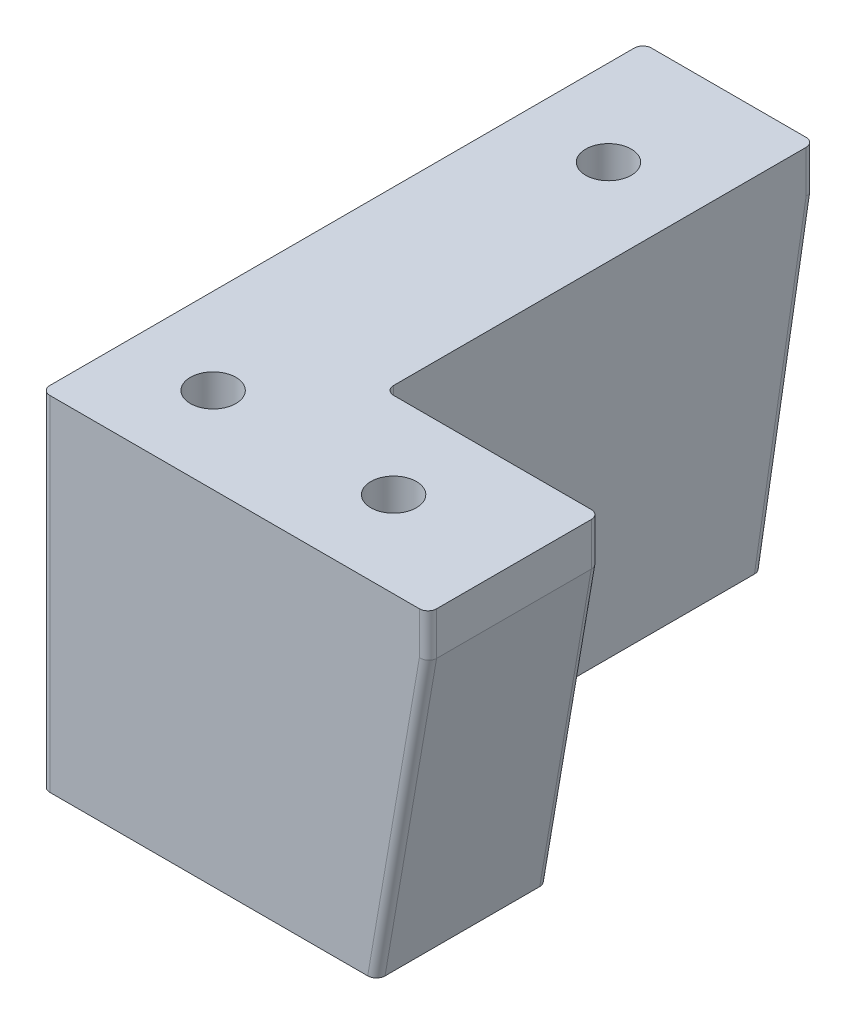
ISO-10303-21;
HEADER;
FILE_DESCRIPTION(('STEP AP214'),'2;1');
FILE_NAME('part.step','',(''),(''),'','','');
FILE_SCHEMA(('AUTOMOTIVE_DESIGN { 1 0 10303 214 1 1 1 1 }'));
ENDSEC;
DATA;
#1=APPLICATION_CONTEXT('core data for automotive mechanical design processes');
#2=APPLICATION_PROTOCOL_DEFINITION('international standard','automotive_design',2000,#1);
#3=PRODUCT_CONTEXT('',#1,'mechanical');
#4=PRODUCT('Part','Part','',(#3));
#5=PRODUCT_RELATED_PRODUCT_CATEGORY('part','',(#4));
#6=PRODUCT_DEFINITION_FORMATION('','',#4);
#7=PRODUCT_DEFINITION_CONTEXT('part definition',#1,'design');
#8=PRODUCT_DEFINITION('design','',#6,#7);
#9=PRODUCT_DEFINITION_SHAPE('','',#8);
#10=(LENGTH_UNIT() NAMED_UNIT(*) SI_UNIT(.MILLI.,.METRE.));
#11=(NAMED_UNIT(*) PLANE_ANGLE_UNIT() SI_UNIT($,.RADIAN.));
#12=(NAMED_UNIT(*) SI_UNIT($,.STERADIAN.) SOLID_ANGLE_UNIT());
#13=UNCERTAINTY_MEASURE_WITH_UNIT(LENGTH_MEASURE(1.E-05),#10,'distance_accuracy_value','');
#14=(GEOMETRIC_REPRESENTATION_CONTEXT(3) GLOBAL_UNCERTAINTY_ASSIGNED_CONTEXT((#13)) GLOBAL_UNIT_ASSIGNED_CONTEXT((#10,
#11,#12)) REPRESENTATION_CONTEXT('',''));
#15=CARTESIAN_POINT('',(0.,0.,0.));
#16=DIRECTION('',(0.,0.,1.));
#17=DIRECTION('',(1.,0.,0.));
#18=AXIS2_PLACEMENT_3D('',#15,#16,#17);
#19=CARTESIAN_POINT('',(31.,-5.,-10.));
#20=DIRECTION('',(0.,-1.,0.));
#21=DIRECTION('',(0.,0.,-1.));
#22=AXIS2_PLACEMENT_3D('',#19,#20,#21);
#23=PLANE('',#22);
#24=CARTESIAN_POINT('',(31.,-5.,-10.));
#25=DIRECTION('',(0.,-1.,0.));
#26=DIRECTION('',(0.,0.,-1.));
#27=AXIS2_PLACEMENT_3D('',#24,#25,#26);
#28=CIRCLE('',#27,5.);
#29=CARTESIAN_POINT('',(31.,-5.,-15.));
#30=VERTEX_POINT('',#29);
#31=EDGE_CURVE('E240',#30,#30,#28,.T.);
#32=ORIENTED_EDGE('',*,*,#31,.T.);
#33=EDGE_LOOP('',(#32));
#34=FACE_BOUND('',#33,.T.);
#35=CARTESIAN_POINT('',(31.,-5.,-10.));
#36=DIRECTION('',(0.,-1.,0.));
#37=DIRECTION('',(0.,0.,-1.));
#38=AXIS2_PLACEMENT_3D('',#35,#36,#37);
#39=CIRCLE('',#38,2.64999999999999);
#40=CARTESIAN_POINT('',(31.,-5.,-12.65));
#41=VERTEX_POINT('',#40);
#42=EDGE_CURVE('E274',#41,#41,#39,.F.);
#43=ORIENTED_EDGE('',*,*,#42,.T.);
#44=EDGE_LOOP('',(#43));
#45=FACE_BOUND('',#44,.T.);
#46=ADVANCED_FACE('F17',(#34,#45),#23,.T.);
#47=CARTESIAN_POINT('',(10.,-5.,-10.));
#48=DIRECTION('',(0.,-1.,0.));
#49=DIRECTION('',(0.,0.,-1.));
#50=AXIS2_PLACEMENT_3D('',#47,#48,#49);
#51=PLANE('',#50);
#52=CARTESIAN_POINT('',(10.,-5.,-10.));
#53=DIRECTION('',(0.,-1.,0.));
#54=DIRECTION('',(0.,0.,-1.));
#55=AXIS2_PLACEMENT_3D('',#52,#53,#54);
#56=CIRCLE('',#55,5.);
#57=CARTESIAN_POINT('',(10.,-5.,-15.));
#58=VERTEX_POINT('',#57);
#59=EDGE_CURVE('E267',#58,#58,#56,.T.);
#60=ORIENTED_EDGE('',*,*,#59,.T.);
#61=EDGE_LOOP('',(#60));
#62=FACE_BOUND('',#61,.T.);
#63=CARTESIAN_POINT('',(10.,-5.,-10.));
#64=DIRECTION('',(0.,-1.,0.));
#65=DIRECTION('',(0.,0.,-1.));
#66=AXIS2_PLACEMENT_3D('',#63,#64,#65);
#67=CIRCLE('',#66,2.64999999999999);
#68=CARTESIAN_POINT('',(10.,-5.,-12.65));
#69=VERTEX_POINT('',#68);
#70=EDGE_CURVE('E277',#69,#69,#67,.F.);
#71=ORIENTED_EDGE('',*,*,#70,.T.);
#72=EDGE_LOOP('',(#71));
#73=FACE_BOUND('',#72,.T.);
#74=ADVANCED_FACE('F592',(#62,#73),#51,.T.);
#75=CARTESIAN_POINT('',(10.,-5.,-56.));
#76=DIRECTION('',(0.,-1.,0.));
#77=DIRECTION('',(0.,0.,-1.));
#78=AXIS2_PLACEMENT_3D('',#75,#76,#77);
#79=PLANE('',#78);
#80=CARTESIAN_POINT('',(10.,-5.,-56.));
#81=DIRECTION('',(0.,-1.,0.));
#82=DIRECTION('',(0.,0.,-1.));
#83=AXIS2_PLACEMENT_3D('',#80,#81,#82);
#84=CIRCLE('',#83,5.);
#85=CARTESIAN_POINT('',(10.,-5.,-61.));
#86=VERTEX_POINT('',#85);
#87=EDGE_CURVE('E243',#86,#86,#84,.T.);
#88=ORIENTED_EDGE('',*,*,#87,.T.);
#89=EDGE_LOOP('',(#88));
#90=FACE_BOUND('',#89,.T.);
#91=CARTESIAN_POINT('',(10.,-5.,-56.));
#92=DIRECTION('',(0.,-1.,0.));
#93=DIRECTION('',(0.,0.,-1.));
#94=AXIS2_PLACEMENT_3D('',#91,#92,#93);
#95=CIRCLE('',#94,2.64999999999999);
#96=CARTESIAN_POINT('',(10.,-5.,-58.65));
#97=VERTEX_POINT('',#96);
#98=EDGE_CURVE('E234',#97,#97,#95,.F.);
#99=ORIENTED_EDGE('',*,*,#98,.T.);
#100=EDGE_LOOP('',(#99));
#101=FACE_BOUND('',#100,.T.);
#102=ADVANCED_FACE('F584',(#90,#101),#79,.T.);
#103=CARTESIAN_POINT('',(19.,-11.6311947891715,-67.8486362701669));
#104=DIRECTION('',(0.,-0.985622254813267,0.168963815110846));
#105=DIRECTION('',(0.,-0.168963815110846,-0.985622254813267));
#106=AXIS2_PLACEMENT_3D('',#103,#104,#105);
#107=CYLINDRICAL_SURFACE('',#106,1.00000000000001);
#108=CARTESIAN_POINT('',(19.,-4.91490636514522,-69.));
#109=DIRECTION('',(0.,0.996399080392306,-0.0847872195166623));
#110=DIRECTION('',(0.,0.0847872195166619,0.996399080392306));
#111=AXIS2_PLACEMENT_3D('',#108,#109,#110);
#112=ELLIPSE('',#111,1.00361393309022,1.);
#113=CARTESIAN_POINT('',(20.,-4.91490636514516,-69.));
#114=VERTEX_POINT('',#113);
#115=CARTESIAN_POINT('',(19.,-5.00000000000011,-70.));
#116=VERTEX_POINT('',#115);
#117=EDGE_CURVE('E135',#114,#116,#112,.T.);
#118=ORIENTED_EDGE('',*,*,#117,.F.);
#119=DIRECTION('',(0.,0.985622254813267,-0.168963815110846));
#120=VECTOR('',#119,1.);
#121=CARTESIAN_POINT('',(20.,-40.,-62.9854125197392));
#122=LINE('',#121,#120);
#123=CARTESIAN_POINT('',(20.,-40.,-62.9854125197392));
#124=VERTEX_POINT('',#123);
#125=EDGE_CURVE('E133',#124,#114,#122,.T.);
#126=ORIENTED_EDGE('',*,*,#125,.F.);
#127=CARTESIAN_POINT('',(19.,-40.,-62.9854125197392));
#128=DIRECTION('',(0.,-1.,0.));
#129=DIRECTION('',(0.,0.,1.));
#130=AXIS2_PLACEMENT_3D('',#127,#128,#129);
#131=ELLIPSE('',#130,1.01458748026085,1.00000000000001);
#132=CARTESIAN_POINT('',(19.,-40.,-64.));
#133=VERTEX_POINT('',#132);
#134=EDGE_CURVE('E20',#124,#133,#131,.F.);
#135=ORIENTED_EDGE('',*,*,#134,.T.);
#136=DIRECTION('',(0.,0.985622254813267,-0.168963815110846));
#137=VECTOR('',#136,1.);
#138=CARTESIAN_POINT('',(19.,-11.8001586042823,-68.8342585249802));
#139=LINE('',#138,#137);
#140=EDGE_CURVE('E130',#116,#133,#139,.F.);
#141=ORIENTED_EDGE('',*,*,#140,.F.);
#142=EDGE_LOOP('',(#118,#126,#135,#141));
#143=FACE_BOUND('',#142,.T.);
#144=ADVANCED_FACE('F129',(#143),#107,.T.);
#145=CARTESIAN_POINT('',(19.,-5.,-69.));
#146=DIRECTION('',(0.,1.,0.));
#147=DIRECTION('',(0.,0.,1.));
#148=AXIS2_PLACEMENT_3D('',#145,#146,#147);
#149=CYLINDRICAL_SURFACE('',#148,1.);
#150=CARTESIAN_POINT('',(19.,0.,-69.));
#151=DIRECTION('',(0.,1.,0.));
#152=DIRECTION('',(0.,0.,1.));
#153=AXIS2_PLACEMENT_3D('',#150,#151,#152);
#154=CIRCLE('',#153,1.);
#155=CARTESIAN_POINT('',(19.,0.,-70.));
#156=VERTEX_POINT('',#155);
#157=CARTESIAN_POINT('',(20.,0.,-69.));
#158=VERTEX_POINT('',#157);
#159=EDGE_CURVE('E297',#156,#158,#154,.F.);
#160=ORIENTED_EDGE('',*,*,#159,.T.);
#161=DIRECTION('',(0.,1.,0.));
#162=VECTOR('',#161,1.);
#163=CARTESIAN_POINT('',(20.,-5.,-69.));
#164=LINE('',#163,#162);
#165=EDGE_CURVE('E209',#114,#158,#164,.T.);
#166=ORIENTED_EDGE('',*,*,#165,.F.);
#167=ORIENTED_EDGE('',*,*,#117,.T.);
#168=DIRECTION('',(0.,1.,0.));
#169=VECTOR('',#168,1.);
#170=CARTESIAN_POINT('',(19.,-5.,-70.));
#171=LINE('',#170,#169);
#172=EDGE_CURVE('E230',#156,#116,#171,.F.);
#173=ORIENTED_EDGE('',*,*,#172,.F.);
#174=EDGE_LOOP('',(#160,#166,#167,#173));
#175=FACE_BOUND('',#174,.T.);
#176=ADVANCED_FACE('F301',(#175),#149,.T.);
#177=CARTESIAN_POINT('',(44.,-5.,-19.));
#178=DIRECTION('',(0.,1.,0.));
#179=DIRECTION('',(0.,0.,1.));
#180=AXIS2_PLACEMENT_3D('',#177,#178,#179);
#181=CYLINDRICAL_SURFACE('',#180,1.);
#182=CARTESIAN_POINT('',(44.,0.,-19.));
#183=DIRECTION('',(0.,1.,0.));
#184=DIRECTION('',(0.,0.,1.));
#185=AXIS2_PLACEMENT_3D('',#182,#183,#184);
#186=CIRCLE('',#185,1.);
#187=CARTESIAN_POINT('',(44.,0.,-20.));
#188=VERTEX_POINT('',#187);
#189=CARTESIAN_POINT('',(45.,0.,-19.));
#190=VERTEX_POINT('',#189);
#191=EDGE_CURVE('E295',#188,#190,#186,.F.);
#192=ORIENTED_EDGE('',*,*,#191,.T.);
#193=DIRECTION('',(0.,1.,0.));
#194=VECTOR('',#193,1.);
#195=CARTESIAN_POINT('',(45.,-5.,-19.));
#196=LINE('',#195,#194);
#197=CARTESIAN_POINT('',(45.,-5.00000000000007,-19.));
#198=VERTEX_POINT('',#197);
#199=EDGE_CURVE('E231',#198,#190,#196,.T.);
#200=ORIENTED_EDGE('',*,*,#199,.F.);
#201=CARTESIAN_POINT('',(44.,-4.91490636514523,-19.));
#202=DIRECTION('',(-0.0847872195166622,-0.996399080392306,0.));
#203=DIRECTION('',(-0.996399080392306,0.0847872195166613,0.));
#204=AXIS2_PLACEMENT_3D('',#201,#202,#203);
#205=ELLIPSE('',#204,1.00361393309022,1.);
#206=CARTESIAN_POINT('',(44.,-4.91490636514521,-20.));
#207=VERTEX_POINT('',#206);
#208=EDGE_CURVE('E290',#207,#198,#205,.T.);
#209=ORIENTED_EDGE('',*,*,#208,.F.);
#210=DIRECTION('',(0.,1.,0.));
#211=VECTOR('',#210,1.);
#212=CARTESIAN_POINT('',(44.,-5.,-20.));
#213=LINE('',#212,#211);
#214=EDGE_CURVE('E207',#188,#207,#213,.F.);
#215=ORIENTED_EDGE('',*,*,#214,.F.);
#216=EDGE_LOOP('',(#192,#200,#209,#215));
#217=FACE_BOUND('',#216,.T.);
#218=ADVANCED_FACE('F358',(#217),#181,.T.);
#219=CARTESIAN_POINT('',(44.0143777451868,-4.83103618488916,-19.));
#220=DIRECTION('',(-0.168963815110846,-0.985622254813267,0.));
#221=DIRECTION('',(0.985622254813267,-0.168963815110846,0.));
#222=AXIS2_PLACEMENT_3D('',#219,#220,#221);
#223=CYLINDRICAL_SURFACE('',#222,1.);
#224=ORIENTED_EDGE('',*,*,#208,.T.);
#225=DIRECTION('',(0.168963815110846,0.985622254813267,0.));
#226=VECTOR('',#225,1.);
#227=CARTESIAN_POINT('',(44.5479777954005,-7.63679619349722,-19.));
#228=LINE('',#227,#226);
#229=CARTESIAN_POINT('',(39.,-40.,-19.));
#230=VERTEX_POINT('',#229);
#231=EDGE_CURVE('E215',#230,#198,#228,.T.);
#232=ORIENTED_EDGE('',*,*,#231,.F.);
#233=CARTESIAN_POINT('',(37.9854125197392,-40.,-19.));
#234=DIRECTION('',(0.,-1.,0.));
#235=DIRECTION('',(-1.,0.,0.));
#236=AXIS2_PLACEMENT_3D('',#233,#234,#235);
#237=ELLIPSE('',#236,1.01458748026084,1.);
#238=CARTESIAN_POINT('',(37.9854125197392,-40.,-20.));
#239=VERTEX_POINT('',#238);
#240=EDGE_CURVE('E293',#230,#239,#237,.F.);
#241=ORIENTED_EDGE('',*,*,#240,.T.);
#242=DIRECTION('',(-0.168963815110846,-0.985622254813267,0.));
#243=VECTOR('',#242,1.);
#244=CARTESIAN_POINT('',(44.,-4.9149063651452,-20.));
#245=LINE('',#244,#243);
#246=EDGE_CURVE('E204',#207,#239,#245,.T.);
#247=ORIENTED_EDGE('',*,*,#246,.F.);
#248=EDGE_LOOP('',(#224,#232,#241,#247));
#249=FACE_BOUND('',#248,.T.);
#250=ADVANCED_FACE('F325',(#249),#223,.T.);
#251=CARTESIAN_POINT('',(21.,-5.,-21.));
#252=DIRECTION('',(0.,-1.,0.));
#253=DIRECTION('',(0.,0.,-1.));
#254=AXIS2_PLACEMENT_3D('',#251,#252,#253);
#255=CYLINDRICAL_SURFACE('',#254,1.);
#256=DIRECTION('',(0.,1.,0.));
#257=VECTOR('',#256,1.);
#258=CARTESIAN_POINT('',(20.,-5.,-21.));
#259=LINE('',#258,#257);
#260=CARTESIAN_POINT('',(20.,0.,-21.));
#261=VERTEX_POINT('',#260);
#262=CARTESIAN_POINT('',(20.,-40.,-21.));
#263=VERTEX_POINT('',#262);
#264=EDGE_CURVE('E143',#261,#263,#259,.F.);
#265=ORIENTED_EDGE('',*,*,#264,.F.);
#266=CARTESIAN_POINT('',(21.,0.,-21.));
#267=DIRECTION('',(0.,-1.,0.));
#268=DIRECTION('',(0.,0.,-1.));
#269=AXIS2_PLACEMENT_3D('',#266,#267,#268);
#270=CIRCLE('',#269,1.);
#271=CARTESIAN_POINT('',(21.,0.,-20.));
#272=VERTEX_POINT('',#271);
#273=EDGE_CURVE('E288',#272,#261,#270,.T.);
#274=ORIENTED_EDGE('',*,*,#273,.F.);
#275=DIRECTION('',(0.,1.,0.));
#276=VECTOR('',#275,1.);
#277=CARTESIAN_POINT('',(21.,-5.,-20.));
#278=LINE('',#277,#276);
#279=CARTESIAN_POINT('',(21.,-40.,-20.));
#280=VERTEX_POINT('',#279);
#281=EDGE_CURVE('E200',#280,#272,#278,.T.);
#282=ORIENTED_EDGE('',*,*,#281,.F.);
#283=CARTESIAN_POINT('',(21.,-40.,-21.));
#284=DIRECTION('',(0.,-1.,0.));
#285=DIRECTION('',(0.,0.,-1.));
#286=AXIS2_PLACEMENT_3D('',#283,#284,#285);
#287=CIRCLE('',#286,1.);
#288=EDGE_CURVE('E286',#263,#280,#287,.F.);
#289=ORIENTED_EDGE('',*,*,#288,.F.);
#290=EDGE_LOOP('',(#265,#274,#282,#289));
#291=FACE_BOUND('',#290,.T.);
#292=ADVANCED_FACE('F318',(#291),#255,.F.);
#293=CARTESIAN_POINT('',(43.5623555405872,-7.46783237838638,-1.));
#294=DIRECTION('',(-0.168963815110846,-0.985622254813267,0.));
#295=DIRECTION('',(0.985622254813267,-0.168963815110846,0.));
#296=AXIS2_PLACEMENT_3D('',#293,#294,#295);
#297=CYLINDRICAL_SURFACE('',#296,1.);
#298=CARTESIAN_POINT('',(44.,-4.91490636514519,-1.));
#299=DIRECTION('',(0.0847872195166622,0.996399080392306,0.));
#300=DIRECTION('',(-0.996399080392306,0.0847872195166613,0.));
#301=AXIS2_PLACEMENT_3D('',#298,#299,#300);
#302=ELLIPSE('',#301,1.00361393309022,1.);
#303=CARTESIAN_POINT('',(44.,-4.91490636514526,0.));
#304=VERTEX_POINT('',#303);
#305=CARTESIAN_POINT('',(45.,-5.00000000000005,-1.));
#306=VERTEX_POINT('',#305);
#307=EDGE_CURVE('E282',#304,#306,#302,.T.);
#308=ORIENTED_EDGE('',*,*,#307,.F.);
#309=DIRECTION('',(0.168963815110846,0.985622254813267,0.));
#310=VECTOR('',#309,1.);
#311=CARTESIAN_POINT('',(37.9854125197392,-40.,0.));
#312=LINE('',#311,#310);
#313=CARTESIAN_POINT('',(37.9854125197392,-40.,0.));
#314=VERTEX_POINT('',#313);
#315=EDGE_CURVE('E203',#314,#304,#312,.T.);
#316=ORIENTED_EDGE('',*,*,#315,.F.);
#317=CARTESIAN_POINT('',(37.9854125197392,-40.,-1.));
#318=DIRECTION('',(0.,-1.,0.));
#319=DIRECTION('',(-1.,0.,0.));
#320=AXIS2_PLACEMENT_3D('',#317,#318,#319);
#321=ELLIPSE('',#320,1.01458748026084,1.);
#322=CARTESIAN_POINT('',(39.,-40.,-1.));
#323=VERTEX_POINT('',#322);
#324=EDGE_CURVE('E284',#314,#323,#321,.F.);
#325=ORIENTED_EDGE('',*,*,#324,.T.);
#326=DIRECTION('',(0.168963815110846,0.985622254813267,0.));
#327=VECTOR('',#326,1.);
#328=CARTESIAN_POINT('',(44.5479777954005,-7.63679619349722,-1.));
#329=LINE('',#328,#327);
#330=EDGE_CURVE('E218',#306,#323,#329,.F.);
#331=ORIENTED_EDGE('',*,*,#330,.F.);
#332=EDGE_LOOP('',(#308,#316,#325,#331));
#333=FACE_BOUND('',#332,.T.);
#334=ADVANCED_FACE('F334',(#333),#297,.T.);
#335=CARTESIAN_POINT('',(44.,-5.,-1.));
#336=DIRECTION('',(0.,1.,0.));
#337=DIRECTION('',(0.,0.,1.));
#338=AXIS2_PLACEMENT_3D('',#335,#336,#337);
#339=CYLINDRICAL_SURFACE('',#338,1.);
#340=CARTESIAN_POINT('',(44.,0.,-1.));
#341=DIRECTION('',(0.,1.,0.));
#342=DIRECTION('',(0.,0.,1.));
#343=AXIS2_PLACEMENT_3D('',#340,#341,#342);
#344=CIRCLE('',#343,1.);
#345=CARTESIAN_POINT('',(45.,0.,-1.));
#346=VERTEX_POINT('',#345);
#347=CARTESIAN_POINT('',(44.,0.,0.));
#348=VERTEX_POINT('',#347);
#349=EDGE_CURVE('E280',#346,#348,#344,.F.);
#350=ORIENTED_EDGE('',*,*,#349,.T.);
#351=DIRECTION('',(0.,1.,0.));
#352=VECTOR('',#351,1.);
#353=CARTESIAN_POINT('',(44.,-5.,0.));
#354=LINE('',#353,#352);
#355=EDGE_CURVE('E214',#304,#348,#354,.T.);
#356=ORIENTED_EDGE('',*,*,#355,.F.);
#357=ORIENTED_EDGE('',*,*,#307,.T.);
#358=DIRECTION('',(0.,1.,0.));
#359=VECTOR('',#358,1.);
#360=CARTESIAN_POINT('',(45.,-5.,-1.));
#361=LINE('',#360,#359);
#362=EDGE_CURVE('E227',#346,#306,#361,.F.);
#363=ORIENTED_EDGE('',*,*,#362,.F.);
#364=EDGE_LOOP('',(#350,#356,#357,#363));
#365=FACE_BOUND('',#364,.T.);
#366=ADVANCED_FACE('F354',(#365),#339,.T.);
#367=CARTESIAN_POINT('',(10.,-5.,-10.));
#368=DIRECTION('',(0.,-1.,0.));
#369=DIRECTION('',(0.,0.,-1.));
#370=AXIS2_PLACEMENT_3D('',#367,#368,#369);
#371=CYLINDRICAL_SURFACE('',#370,2.64999999999999);
#372=CARTESIAN_POINT('',(10.,0.,-10.));
#373=DIRECTION('',(0.,-1.,0.));
#374=DIRECTION('',(0.,0.,-1.));
#375=AXIS2_PLACEMENT_3D('',#372,#373,#374);
#376=CIRCLE('',#375,2.64999999999999);
#377=CARTESIAN_POINT('',(10.,0.,-12.65));
#378=VERTEX_POINT('',#377);
#379=EDGE_CURVE('E237',#378,#378,#376,.T.);
#380=ORIENTED_EDGE('',*,*,#379,.F.);
#381=EDGE_LOOP('',(#380));
#382=FACE_BOUND('',#381,.T.);
#383=ORIENTED_EDGE('',*,*,#70,.F.);
#384=EDGE_LOOP('',(#383));
#385=FACE_BOUND('',#384,.T.);
#386=ADVANCED_FACE('F416',(#382,#385),#371,.F.);
#387=CARTESIAN_POINT('',(31.,-5.,-10.));
#388=DIRECTION('',(0.,-1.,0.));
#389=DIRECTION('',(0.,0.,-1.));
#390=AXIS2_PLACEMENT_3D('',#387,#388,#389);
#391=CYLINDRICAL_SURFACE('',#390,2.64999999999999);
#392=CARTESIAN_POINT('',(31.,0.,-10.));
#393=DIRECTION('',(0.,-1.,0.));
#394=DIRECTION('',(0.,0.,-1.));
#395=AXIS2_PLACEMENT_3D('',#392,#393,#394);
#396=CIRCLE('',#395,2.64999999999999);
#397=CARTESIAN_POINT('',(31.,0.,-12.65));
#398=VERTEX_POINT('',#397);
#399=EDGE_CURVE('E260',#398,#398,#396,.T.);
#400=ORIENTED_EDGE('',*,*,#399,.F.);
#401=EDGE_LOOP('',(#400));
#402=FACE_BOUND('',#401,.T.);
#403=ORIENTED_EDGE('',*,*,#42,.F.);
#404=EDGE_LOOP('',(#403));
#405=FACE_BOUND('',#404,.T.);
#406=ADVANCED_FACE('F412',(#402,#405),#391,.F.);
#407=CARTESIAN_POINT('',(10.,-5.,-56.));
#408=DIRECTION('',(0.,-1.,0.));
#409=DIRECTION('',(0.,0.,-1.));
#410=AXIS2_PLACEMENT_3D('',#407,#408,#409);
#411=CYLINDRICAL_SURFACE('',#410,2.64999999999999);
#412=CARTESIAN_POINT('',(10.,0.,-56.));
#413=DIRECTION('',(0.,-1.,0.));
#414=DIRECTION('',(0.,0.,-1.));
#415=AXIS2_PLACEMENT_3D('',#412,#413,#414);
#416=CIRCLE('',#415,2.64999999999999);
#417=CARTESIAN_POINT('',(10.,0.,-58.65));
#418=VERTEX_POINT('',#417);
#419=EDGE_CURVE('E196',#418,#418,#416,.T.);
#420=ORIENTED_EDGE('',*,*,#419,.F.);
#421=EDGE_LOOP('',(#420));
#422=FACE_BOUND('',#421,.T.);
#423=ORIENTED_EDGE('',*,*,#98,.F.);
#424=EDGE_LOOP('',(#423));
#425=FACE_BOUND('',#424,.T.);
#426=ADVANCED_FACE('F409',(#422,#425),#411,.F.);
#427=CARTESIAN_POINT('',(45.,-5.,0.));
#428=DIRECTION('',(1.,0.,0.));
#429=DIRECTION('',(0.,0.,-1.));
#430=AXIS2_PLACEMENT_3D('',#427,#428,#429);
#431=PLANE('',#430);
#432=DIRECTION('',(0.,0.,1.));
#433=VECTOR('',#432,1.);
#434=CARTESIAN_POINT('',(45.,0.,0.));
#435=LINE('',#434,#433);
#436=EDGE_CURVE('E188',#346,#190,#435,.F.);
#437=ORIENTED_EDGE('',*,*,#436,.F.);
#438=ORIENTED_EDGE('',*,*,#362,.T.);
#439=DIRECTION('',(0.,0.,1.));
#440=VECTOR('',#439,1.);
#441=CARTESIAN_POINT('',(45.,-5.,0.));
#442=LINE('',#441,#440);
#443=EDGE_CURVE('E221',#198,#306,#442,.T.);
#444=ORIENTED_EDGE('',*,*,#443,.F.);
#445=ORIENTED_EDGE('',*,*,#199,.T.);
#446=EDGE_LOOP('',(#437,#438,#444,#445));
#447=FACE_BOUND('',#446,.T.);
#448=ADVANCED_FACE('F356',(#447),#431,.T.);
#449=CARTESIAN_POINT('',(20.,-5.,-70.));
#450=DIRECTION('',(0.,0.,-1.));
#451=DIRECTION('',(-1.,0.,0.));
#452=AXIS2_PLACEMENT_3D('',#449,#450,#451);
#453=PLANE('',#452);
#454=DIRECTION('',(1.,0.,0.));
#455=VECTOR('',#454,1.);
#456=CARTESIAN_POINT('',(0.,0.,-70.));
#457=LINE('',#456,#455);
#458=CARTESIAN_POINT('',(0.999999999999997,0.,-70.));
#459=VERTEX_POINT('',#458);
#460=EDGE_CURVE('E194',#156,#459,#457,.F.);
#461=ORIENTED_EDGE('',*,*,#460,.F.);
#462=ORIENTED_EDGE('',*,*,#172,.T.);
#463=DIRECTION('',(1.,0.,0.));
#464=VECTOR('',#463,1.);
#465=CARTESIAN_POINT('',(0.,-5.00000000000001,-70.));
#466=LINE('',#465,#464);
#467=CARTESIAN_POINT('',(0.999999999999997,-5.00000000000009,-70.));
#468=VERTEX_POINT('',#467);
#469=EDGE_CURVE('E142',#468,#116,#466,.T.);
#470=ORIENTED_EDGE('',*,*,#469,.F.);
#471=DIRECTION('',(0.,1.,0.));
#472=VECTOR('',#471,1.);
#473=CARTESIAN_POINT('',(0.999999999999998,-5.,-70.));
#474=LINE('',#473,#472);
#475=EDGE_CURVE('E175',#459,#468,#474,.F.);
#476=ORIENTED_EDGE('',*,*,#475,.F.);
#477=EDGE_LOOP('',(#461,#462,#470,#476));
#478=FACE_BOUND('',#477,.T.);
#479=ADVANCED_FACE('F304',(#478),#453,.T.);
#480=CARTESIAN_POINT('',(31.,-5.,-10.));
#481=DIRECTION('',(0.,-1.,0.));
#482=DIRECTION('',(0.,0.,-1.));
#483=AXIS2_PLACEMENT_3D('',#480,#481,#482);
#484=CYLINDRICAL_SURFACE('',#483,5.);
#485=CARTESIAN_POINT('',(31.,-40.,-10.));
#486=DIRECTION('',(0.,-1.,0.));
#487=DIRECTION('',(0.,0.,-1.));
#488=AXIS2_PLACEMENT_3D('',#485,#486,#487);
#489=CIRCLE('',#488,5.);
#490=CARTESIAN_POINT('',(31.,-40.,-15.));
#491=VERTEX_POINT('',#490);
#492=EDGE_CURVE('E170',#491,#491,#489,.F.);
#493=ORIENTED_EDGE('',*,*,#492,.F.);
#494=EDGE_LOOP('',(#493));
#495=FACE_BOUND('',#494,.T.);
#496=ORIENTED_EDGE('',*,*,#31,.F.);
#497=EDGE_LOOP('',(#496));
#498=FACE_BOUND('',#497,.T.);
#499=ADVANCED_FACE('F400',(#495,#498),#484,.F.);
#500=CARTESIAN_POINT('',(10.,-5.,-10.));
#501=DIRECTION('',(0.,-1.,0.));
#502=DIRECTION('',(0.,0.,-1.));
#503=AXIS2_PLACEMENT_3D('',#500,#501,#502);
#504=CYLINDRICAL_SURFACE('',#503,5.);
#505=CARTESIAN_POINT('',(10.,-40.,-10.));
#506=DIRECTION('',(0.,-1.,0.));
#507=DIRECTION('',(0.,0.,-1.));
#508=AXIS2_PLACEMENT_3D('',#505,#506,#507);
#509=CIRCLE('',#508,5.);
#510=CARTESIAN_POINT('',(10.,-40.,-15.));
#511=VERTEX_POINT('',#510);
#512=EDGE_CURVE('E249',#511,#511,#509,.F.);
#513=ORIENTED_EDGE('',*,*,#512,.F.);
#514=EDGE_LOOP('',(#513));
#515=FACE_BOUND('',#514,.T.);
#516=ORIENTED_EDGE('',*,*,#59,.F.);
#517=EDGE_LOOP('',(#516));
#518=FACE_BOUND('',#517,.T.);
#519=ADVANCED_FACE('F396',(#515,#518),#504,.F.);
#520=CARTESIAN_POINT('',(10.,-5.,-56.));
#521=DIRECTION('',(0.,-1.,0.));
#522=DIRECTION('',(0.,0.,-1.));
#523=AXIS2_PLACEMENT_3D('',#520,#521,#522);
#524=CYLINDRICAL_SURFACE('',#523,5.);
#525=CARTESIAN_POINT('',(10.,-40.,-56.));
#526=DIRECTION('',(0.,-1.,0.));
#527=DIRECTION('',(0.,0.,-1.));
#528=AXIS2_PLACEMENT_3D('',#525,#526,#527);
#529=CIRCLE('',#528,5.);
#530=CARTESIAN_POINT('',(10.,-40.,-61.));
#531=VERTEX_POINT('',#530);
#532=EDGE_CURVE('E161',#531,#531,#529,.F.);
#533=ORIENTED_EDGE('',*,*,#532,.F.);
#534=EDGE_LOOP('',(#533));
#535=FACE_BOUND('',#534,.T.);
#536=ORIENTED_EDGE('',*,*,#87,.F.);
#537=EDGE_LOOP('',(#536));
#538=FACE_BOUND('',#537,.T.);
#539=ADVANCED_FACE('F393',(#535,#538),#524,.F.);
#540=CARTESIAN_POINT('',(44.5479777954005,-7.63679619349722,0.));
#541=DIRECTION('',(0.985622254813267,-0.168963815110846,0.));
#542=DIRECTION('',(0.168963815110846,0.985622254813267,0.));
#543=AXIS2_PLACEMENT_3D('',#540,#541,#542);
#544=PLANE('',#543);
#545=DIRECTION('',(0.,0.,-1.));
#546=VECTOR('',#545,1.);
#547=CARTESIAN_POINT('',(39.,-40.,0.));
#548=LINE('',#547,#546);
#549=EDGE_CURVE('E158',#230,#323,#548,.F.);
#550=ORIENTED_EDGE('',*,*,#549,.F.);
#551=ORIENTED_EDGE('',*,*,#231,.T.);
#552=ORIENTED_EDGE('',*,*,#443,.T.);
#553=ORIENTED_EDGE('',*,*,#330,.T.);
#554=EDGE_LOOP('',(#550,#551,#552,#553));
#555=FACE_BOUND('',#554,.T.);
#556=ADVANCED_FACE('F330',(#555),#544,.T.);
#557=CARTESIAN_POINT('',(0.,-11.8001586042823,-68.8342585249802));
#558=DIRECTION('',(0.,-0.168963815110846,-0.985622254813267));
#559=DIRECTION('',(0.,0.985622254813267,-0.168963815110846));
#560=AXIS2_PLACEMENT_3D('',#557,#558,#559);
#561=PLANE('',#560);
#562=DIRECTION('',(1.,0.,0.));
#563=VECTOR('',#562,1.);
#564=CARTESIAN_POINT('',(0.,-40.,-64.));
#565=LINE('',#564,#563);
#566=CARTESIAN_POINT('',(0.999999999999997,-40.,-64.));
#567=VERTEX_POINT('',#566);
#568=EDGE_CURVE('E140',#567,#133,#565,.T.);
#569=ORIENTED_EDGE('',*,*,#568,.F.);
#570=DIRECTION('',(0.,-0.985622254813267,0.168963815110846));
#571=VECTOR('',#570,1.);
#572=CARTESIAN_POINT('',(0.999999999999997,-5.00000000000001,-70.));
#573=LINE('',#572,#571);
#574=EDGE_CURVE('E168',#468,#567,#573,.T.);
#575=ORIENTED_EDGE('',*,*,#574,.F.);
#576=ORIENTED_EDGE('',*,*,#469,.T.);
#577=ORIENTED_EDGE('',*,*,#140,.T.);
#578=EDGE_LOOP('',(#569,#575,#576,#577));
#579=FACE_BOUND('',#578,.T.);
#580=ADVANCED_FACE('F138',(#579),#561,.T.);
#581=CARTESIAN_POINT('',(20.,-5.,-20.));
#582=DIRECTION('',(1.,0.,0.));
#583=DIRECTION('',(0.,0.,-1.));
#584=AXIS2_PLACEMENT_3D('',#581,#582,#583);
#585=PLANE('',#584);
#586=ORIENTED_EDGE('',*,*,#125,.T.);
#587=ORIENTED_EDGE('',*,*,#165,.T.);
#588=DIRECTION('',(0.,0.,1.));
#589=VECTOR('',#588,1.);
#590=CARTESIAN_POINT('',(20.,0.,0.));
#591=LINE('',#590,#589);
#592=EDGE_CURVE('E182',#261,#158,#591,.F.);
#593=ORIENTED_EDGE('',*,*,#592,.F.);
#594=ORIENTED_EDGE('',*,*,#264,.T.);
#595=DIRECTION('',(0.,0.,-1.));
#596=VECTOR('',#595,1.);
#597=CARTESIAN_POINT('',(20.,-40.,0.));
#598=LINE('',#597,#596);
#599=EDGE_CURVE('E149',#124,#263,#598,.F.);
#600=ORIENTED_EDGE('',*,*,#599,.F.);
#601=EDGE_LOOP('',(#586,#587,#593,#594,#600));
#602=FACE_BOUND('',#601,.T.);
#603=ADVANCED_FACE('F313',(#602),#585,.T.);
#604=CARTESIAN_POINT('',(45.,-5.,-20.));
#605=DIRECTION('',(0.,0.,-1.));
#606=DIRECTION('',(-1.,0.,0.));
#607=AXIS2_PLACEMENT_3D('',#604,#605,#606);
#608=PLANE('',#607);
#609=DIRECTION('',(1.,0.,0.));
#610=VECTOR('',#609,1.);
#611=CARTESIAN_POINT('',(0.,-40.,-20.));
#612=LINE('',#611,#610);
#613=EDGE_CURVE('E151',#280,#239,#612,.T.);
#614=ORIENTED_EDGE('',*,*,#613,.F.);
#615=ORIENTED_EDGE('',*,*,#281,.T.);
#616=DIRECTION('',(1.,0.,0.));
#617=VECTOR('',#616,1.);
#618=CARTESIAN_POINT('',(0.,0.,-20.));
#619=LINE('',#618,#617);
#620=EDGE_CURVE('E185',#188,#272,#619,.F.);
#621=ORIENTED_EDGE('',*,*,#620,.F.);
#622=ORIENTED_EDGE('',*,*,#214,.T.);
#623=ORIENTED_EDGE('',*,*,#246,.T.);
#624=EDGE_LOOP('',(#614,#615,#621,#622,#623));
#625=FACE_BOUND('',#624,.T.);
#626=ADVANCED_FACE('F321',(#625),#608,.T.);
#627=CARTESIAN_POINT('',(0.,-5.,0.));
#628=DIRECTION('',(0.,0.,1.));
#629=DIRECTION('',(1.,0.,0.));
#630=AXIS2_PLACEMENT_3D('',#627,#628,#629);
#631=PLANE('',#630);
#632=DIRECTION('',(0.,1.,0.));
#633=VECTOR('',#632,1.);
#634=CARTESIAN_POINT('',(1.,-5.,0.));
#635=LINE('',#634,#633);
#636=CARTESIAN_POINT('',(1.,-40.,0.));
#637=VERTEX_POINT('',#636);
#638=CARTESIAN_POINT('',(1.,0.,0.));
#639=VERTEX_POINT('',#638);
#640=EDGE_CURVE('E197',#637,#639,#635,.T.);
#641=ORIENTED_EDGE('',*,*,#640,.F.);
#642=DIRECTION('',(1.,0.,0.));
#643=VECTOR('',#642,1.);
#644=CARTESIAN_POINT('',(0.,-40.,0.));
#645=LINE('',#644,#643);
#646=EDGE_CURVE('E153',#314,#637,#645,.F.);
#647=ORIENTED_EDGE('',*,*,#646,.F.);
#648=ORIENTED_EDGE('',*,*,#315,.T.);
#649=ORIENTED_EDGE('',*,*,#355,.T.);
#650=DIRECTION('',(1.,0.,0.));
#651=VECTOR('',#650,1.);
#652=CARTESIAN_POINT('',(0.,0.,0.));
#653=LINE('',#652,#651);
#654=EDGE_CURVE('E191',#639,#348,#653,.T.);
#655=ORIENTED_EDGE('',*,*,#654,.F.);
#656=EDGE_LOOP('',(#641,#647,#648,#649,#655));
#657=FACE_BOUND('',#656,.T.);
#658=ADVANCED_FACE('F339',(#657),#631,.T.);
#659=CARTESIAN_POINT('',(0.,0.,0.));
#660=DIRECTION('',(0.,1.,0.));
#661=DIRECTION('',(0.,0.,1.));
#662=AXIS2_PLACEMENT_3D('',#659,#660,#661);
#663=PLANE('',#662);
#664=ORIENTED_EDGE('',*,*,#592,.T.);
#665=ORIENTED_EDGE('',*,*,#159,.F.);
#666=ORIENTED_EDGE('',*,*,#460,.T.);
#667=CARTESIAN_POINT('',(0.999999999999997,0.,-69.));
#668=DIRECTION('',(0.,1.,0.));
#669=DIRECTION('',(0.,0.,1.));
#670=AXIS2_PLACEMENT_3D('',#667,#668,#669);
#671=CIRCLE('',#670,1.);
#672=CARTESIAN_POINT('',(0.,0.,-69.));
#673=VERTEX_POINT('',#672);
#674=EDGE_CURVE('E178',#673,#459,#671,.F.);
#675=ORIENTED_EDGE('',*,*,#674,.F.);
#676=DIRECTION('',(0.,0.,1.));
#677=VECTOR('',#676,1.);
#678=CARTESIAN_POINT('',(0.,0.,-70.));
#679=LINE('',#678,#677);
#680=CARTESIAN_POINT('',(0.,0.,-1.));
#681=VERTEX_POINT('',#680);
#682=EDGE_CURVE('E174',#681,#673,#679,.F.);
#683=ORIENTED_EDGE('',*,*,#682,.F.);
#684=CARTESIAN_POINT('',(1.,0.,-1.));
#685=DIRECTION('',(0.,1.,0.));
#686=DIRECTION('',(0.,0.,1.));
#687=AXIS2_PLACEMENT_3D('',#684,#685,#686);
#688=CIRCLE('',#687,1.);
#689=EDGE_CURVE('E181',#639,#681,#688,.F.);
#690=ORIENTED_EDGE('',*,*,#689,.F.);
#691=ORIENTED_EDGE('',*,*,#654,.T.);
#692=ORIENTED_EDGE('',*,*,#349,.F.);
#693=ORIENTED_EDGE('',*,*,#436,.T.);
#694=ORIENTED_EDGE('',*,*,#191,.F.);
#695=ORIENTED_EDGE('',*,*,#620,.T.);
#696=ORIENTED_EDGE('',*,*,#273,.T.);
#697=EDGE_LOOP('',(#664,#665,#666,#675,#683,#690,#691,#692,#693,#694,#695,#696));
#698=FACE_BOUND('',#697,.T.);
#699=ORIENTED_EDGE('',*,*,#419,.T.);
#700=EDGE_LOOP('',(#699));
#701=FACE_BOUND('',#700,.T.);
#702=ORIENTED_EDGE('',*,*,#399,.T.);
#703=EDGE_LOOP('',(#702));
#704=FACE_BOUND('',#703,.T.);
#705=ORIENTED_EDGE('',*,*,#379,.T.);
#706=EDGE_LOOP('',(#705));
#707=FACE_BOUND('',#706,.T.);
#708=ADVANCED_FACE('F307',(#698,#701,#704,#707),#663,.T.);
#709=CARTESIAN_POINT('',(0.999999999999997,-5.,-69.));
#710=DIRECTION('',(0.,1.,0.));
#711=DIRECTION('',(0.,0.,1.));
#712=AXIS2_PLACEMENT_3D('',#709,#710,#711);
#713=CYLINDRICAL_SURFACE('',#712,1.);
#714=ORIENTED_EDGE('',*,*,#674,.T.);
#715=ORIENTED_EDGE('',*,*,#475,.T.);
#716=CARTESIAN_POINT('',(0.999999999999997,-4.91490636514523,-69.));
#717=DIRECTION('',(0.,-0.996399080392306,0.0847872195166623));
#718=DIRECTION('',(0.,0.0847872195166619,0.996399080392306));
#719=AXIS2_PLACEMENT_3D('',#716,#717,#718);
#720=ELLIPSE('',#719,1.00361393309022,1.);
#721=CARTESIAN_POINT('',(0.,-4.91490636514523,-69.));
#722=VERTEX_POINT('',#721);
#723=EDGE_CURVE('E171',#722,#468,#720,.T.);
#724=ORIENTED_EDGE('',*,*,#723,.F.);
#725=DIRECTION('',(0.,1.,0.));
#726=VECTOR('',#725,1.);
#727=CARTESIAN_POINT('',(0.,-5.,-69.));
#728=LINE('',#727,#726);
#729=EDGE_CURVE('E165',#673,#722,#728,.F.);
#730=ORIENTED_EDGE('',*,*,#729,.F.);
#731=EDGE_LOOP('',(#714,#715,#724,#730));
#732=FACE_BOUND('',#731,.T.);
#733=ADVANCED_FACE('F350',(#732),#713,.T.);
#734=CARTESIAN_POINT('',(0.999999999999997,-4.83103618488916,-69.0143777451868));
#735=DIRECTION('',(0.,-0.985622254813267,0.168963815110846));
#736=DIRECTION('',(0.,-0.168963815110846,-0.985622254813267));
#737=AXIS2_PLACEMENT_3D('',#734,#735,#736);
#738=CYLINDRICAL_SURFACE('',#737,1.00000000000001);
#739=ORIENTED_EDGE('',*,*,#723,.T.);
#740=ORIENTED_EDGE('',*,*,#574,.T.);
#741=CARTESIAN_POINT('',(0.999999999999997,-40.,-62.9854125197392));
#742=DIRECTION('',(0.,-1.,0.));
#743=DIRECTION('',(0.,0.,1.));
#744=AXIS2_PLACEMENT_3D('',#741,#742,#743);
#745=ELLIPSE('',#744,1.01458748026085,1.00000000000001);
#746=CARTESIAN_POINT('',(0.,-40.,-62.9854125197392));
#747=VERTEX_POINT('',#746);
#748=EDGE_CURVE('E148',#747,#567,#745,.T.);
#749=ORIENTED_EDGE('',*,*,#748,.F.);
#750=DIRECTION('',(0.,-0.985622254813267,0.168963815110846));
#751=VECTOR('',#750,1.);
#752=CARTESIAN_POINT('',(0.,-4.91490636514522,-69.));
#753=LINE('',#752,#751);
#754=EDGE_CURVE('E162',#722,#747,#753,.T.);
#755=ORIENTED_EDGE('',*,*,#754,.F.);
#756=EDGE_LOOP('',(#739,#740,#749,#755));
#757=FACE_BOUND('',#756,.T.);
#758=ADVANCED_FACE('F348',(#757),#738,.T.);
#759=CARTESIAN_POINT('',(0.,-40.,0.));
#760=DIRECTION('',(0.,-1.,0.));
#761=DIRECTION('',(0.,0.,-1.));
#762=AXIS2_PLACEMENT_3D('',#759,#760,#761);
#763=PLANE('',#762);
#764=ORIENTED_EDGE('',*,*,#613,.T.);
#765=ORIENTED_EDGE('',*,*,#240,.F.);
#766=ORIENTED_EDGE('',*,*,#549,.T.);
#767=ORIENTED_EDGE('',*,*,#324,.F.);
#768=ORIENTED_EDGE('',*,*,#646,.T.);
#769=CARTESIAN_POINT('',(1.,-40.,-1.));
#770=DIRECTION('',(0.,1.,0.));
#771=DIRECTION('',(0.,0.,1.));
#772=AXIS2_PLACEMENT_3D('',#769,#770,#771);
#773=CIRCLE('',#772,1.);
#774=CARTESIAN_POINT('',(0.,-40.,-1.));
#775=VERTEX_POINT('',#774);
#776=EDGE_CURVE('E35',#775,#637,#773,.T.);
#777=ORIENTED_EDGE('',*,*,#776,.F.);
#778=DIRECTION('',(0.,0.,1.));
#779=VECTOR('',#778,1.);
#780=CARTESIAN_POINT('',(0.,-40.,-70.));
#781=LINE('',#780,#779);
#782=EDGE_CURVE('E26',#747,#775,#781,.T.);
#783=ORIENTED_EDGE('',*,*,#782,.F.);
#784=ORIENTED_EDGE('',*,*,#748,.T.);
#785=ORIENTED_EDGE('',*,*,#568,.T.);
#786=ORIENTED_EDGE('',*,*,#134,.F.);
#787=ORIENTED_EDGE('',*,*,#599,.T.);
#788=ORIENTED_EDGE('',*,*,#288,.T.);
#789=EDGE_LOOP('',(#764,#765,#766,#767,#768,#777,#783,#784,#785,#786,#787,#788));
#790=FACE_BOUND('',#789,.T.);
#791=ORIENTED_EDGE('',*,*,#532,.T.);
#792=EDGE_LOOP('',(#791));
#793=FACE_BOUND('',#792,.T.);
#794=ORIENTED_EDGE('',*,*,#512,.T.);
#795=EDGE_LOOP('',(#794));
#796=FACE_BOUND('',#795,.T.);
#797=ORIENTED_EDGE('',*,*,#492,.T.);
#798=EDGE_LOOP('',(#797));
#799=FACE_BOUND('',#798,.T.);
#800=ADVANCED_FACE('F146',(#790,#793,#796,#799),#763,.T.);
#801=CARTESIAN_POINT('',(1.,-5.,-1.));
#802=DIRECTION('',(0.,1.,0.));
#803=DIRECTION('',(0.,0.,1.));
#804=AXIS2_PLACEMENT_3D('',#801,#802,#803);
#805=CYLINDRICAL_SURFACE('',#804,1.);
#806=ORIENTED_EDGE('',*,*,#689,.T.);
#807=DIRECTION('',(0.,1.,0.));
#808=VECTOR('',#807,1.);
#809=CARTESIAN_POINT('',(0.,-5.,-1.));
#810=LINE('',#809,#808);
#811=EDGE_CURVE('E11',#775,#681,#810,.T.);
#812=ORIENTED_EDGE('',*,*,#811,.F.);
#813=ORIENTED_EDGE('',*,*,#776,.T.);
#814=ORIENTED_EDGE('',*,*,#640,.T.);
#815=EDGE_LOOP('',(#806,#812,#813,#814));
#816=FACE_BOUND('',#815,.T.);
#817=ADVANCED_FACE('F343',(#816),#805,.T.);
#818=CARTESIAN_POINT('',(0.,-5.,-70.));
#819=DIRECTION('',(-1.,0.,0.));
#820=DIRECTION('',(0.,0.,1.));
#821=AXIS2_PLACEMENT_3D('',#818,#819,#820);
#822=PLANE('',#821);
#823=ORIENTED_EDGE('',*,*,#782,.T.);
#824=ORIENTED_EDGE('',*,*,#811,.T.);
#825=ORIENTED_EDGE('',*,*,#682,.T.);
#826=ORIENTED_EDGE('',*,*,#729,.T.);
#827=ORIENTED_EDGE('',*,*,#754,.T.);
#828=EDGE_LOOP('',(#823,#824,#825,#826,#827));
#829=FACE_BOUND('',#828,.T.);
#830=ADVANCED_FACE('F345',(#829),#822,.T.);
#831=CLOSED_SHELL('',(#46,#74,#102,#144,#176,#218,#250,#292,#334,#366,#386,#406,#426,#448,#479,
#499,#519,#539,#556,#580,#603,#626,#658,#708,#733,#758,#800,#817,#830));
#832=MANIFOLD_SOLID_BREP('B1',#831);
#833=ADVANCED_BREP_SHAPE_REPRESENTATION('',(#18,#832),#14);
#834=SHAPE_DEFINITION_REPRESENTATION(#9,#833);
ENDSEC;
END-ISO-10303-21;
